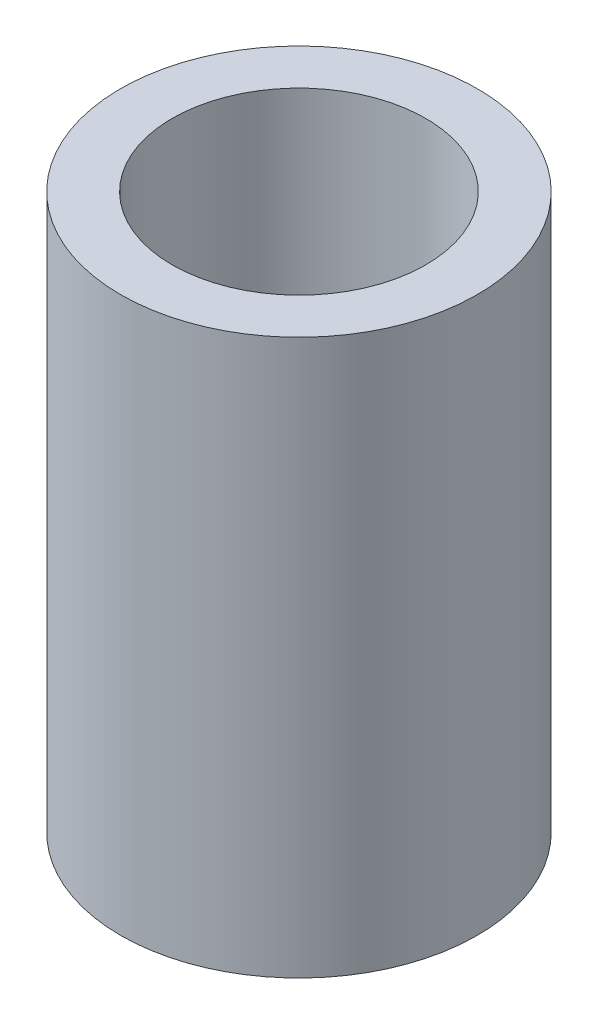
ISO-10303-21;
HEADER;
FILE_DESCRIPTION(('STEP AP214'),'2;1');
FILE_NAME('part.step','',(''),(''),'','','');
FILE_SCHEMA(('AUTOMOTIVE_DESIGN { 1 0 10303 214 1 1 1 1 }'));
ENDSEC;
DATA;
#1=APPLICATION_CONTEXT('core data for automotive mechanical design processes');
#2=APPLICATION_PROTOCOL_DEFINITION('international standard','automotive_design',2000,#1);
#3=PRODUCT_CONTEXT('',#1,'mechanical');
#4=PRODUCT('Part','Part','',(#3));
#5=PRODUCT_RELATED_PRODUCT_CATEGORY('part','',(#4));
#6=PRODUCT_DEFINITION_FORMATION('','',#4);
#7=PRODUCT_DEFINITION_CONTEXT('part definition',#1,'design');
#8=PRODUCT_DEFINITION('design','',#6,#7);
#9=PRODUCT_DEFINITION_SHAPE('','',#8);
#10=(LENGTH_UNIT() NAMED_UNIT(*) SI_UNIT(.MILLI.,.METRE.));
#11=(NAMED_UNIT(*) PLANE_ANGLE_UNIT() SI_UNIT($,.RADIAN.));
#12=(NAMED_UNIT(*) SI_UNIT($,.STERADIAN.) SOLID_ANGLE_UNIT());
#13=UNCERTAINTY_MEASURE_WITH_UNIT(LENGTH_MEASURE(1.E-05),#10,'distance_accuracy_value','');
#14=(GEOMETRIC_REPRESENTATION_CONTEXT(3) GLOBAL_UNCERTAINTY_ASSIGNED_CONTEXT((#13)) GLOBAL_UNIT_ASSIGNED_CONTEXT((#10,
#11,#12)) REPRESENTATION_CONTEXT('',''));
#15=CARTESIAN_POINT('',(0.,0.,0.));
#16=DIRECTION('',(0.,0.,1.));
#17=DIRECTION('',(1.,0.,0.));
#18=AXIS2_PLACEMENT_3D('',#15,#16,#17);
#19=CARTESIAN_POINT('',(0.,21.,0.));
#20=DIRECTION('',(0.,-1.,0.));
#21=DIRECTION('',(0.,0.,-1.));
#22=AXIS2_PLACEMENT_3D('',#19,#20,#21);
#23=CYLINDRICAL_SURFACE('',#22,6.75);
#24=CARTESIAN_POINT('',(0.,21.,0.));
#25=DIRECTION('',(0.,1.,0.));
#26=DIRECTION('',(0.,0.,1.));
#27=AXIS2_PLACEMENT_3D('',#24,#25,#26);
#28=CIRCLE('',#27,6.75);
#29=CARTESIAN_POINT('',(0.,21.,6.75));
#30=VERTEX_POINT('',#29);
#31=EDGE_CURVE('E11',#30,#30,#28,.T.);
#32=ORIENTED_EDGE('',*,*,#31,.F.);
#33=EDGE_LOOP('',(#32));
#34=FACE_BOUND('',#33,.T.);
#35=CARTESIAN_POINT('',(0.,0.,0.));
#36=DIRECTION('',(0.,1.,0.));
#37=DIRECTION('',(0.,0.,1.));
#38=AXIS2_PLACEMENT_3D('',#35,#36,#37);
#39=CIRCLE('',#38,6.75);
#40=CARTESIAN_POINT('',(0.,0.,6.75));
#41=VERTEX_POINT('',#40);
#42=EDGE_CURVE('E42',#41,#41,#39,.T.);
#43=ORIENTED_EDGE('',*,*,#42,.T.);
#44=EDGE_LOOP('',(#43));
#45=FACE_BOUND('',#44,.T.);
#46=ADVANCED_FACE('F39',(#34,#45),#23,.T.);
#47=CARTESIAN_POINT('',(0.,21.,0.));
#48=DIRECTION('',(0.,1.,0.));
#49=DIRECTION('',(0.,0.,1.));
#50=AXIS2_PLACEMENT_3D('',#47,#48,#49);
#51=PLANE('',#50);
#52=CARTESIAN_POINT('',(0.,21.,0.));
#53=DIRECTION('',(0.,1.,0.));
#54=DIRECTION('',(0.,0.,1.));
#55=AXIS2_PLACEMENT_3D('',#52,#53,#54);
#56=CIRCLE('',#55,4.8);
#57=CARTESIAN_POINT('',(0.,21.,4.8));
#58=VERTEX_POINT('',#57);
#59=EDGE_CURVE('E71',#58,#58,#56,.T.);
#60=ORIENTED_EDGE('',*,*,#59,.F.);
#61=EDGE_LOOP('',(#60));
#62=FACE_BOUND('',#61,.T.);
#63=ORIENTED_EDGE('',*,*,#31,.T.);
#64=EDGE_LOOP('',(#63));
#65=FACE_BOUND('',#64,.T.);
#66=ADVANCED_FACE('F100',(#62,#65),#51,.T.);
#67=CARTESIAN_POINT('',(0.,0.,0.));
#68=DIRECTION('',(0.,1.,0.));
#69=DIRECTION('',(0.,0.,1.));
#70=AXIS2_PLACEMENT_3D('',#67,#68,#69);
#71=PLANE('',#70);
#72=DIRECTION('',(1.,0.,0.));
#73=VECTOR('',#72,1.);
#74=CARTESIAN_POINT('',(-1.29747385997555,0.,-1.09843597113357));
#75=LINE('',#74,#73);
#76=CARTESIAN_POINT('',(-1.29747385997555,0.,-1.09843597113357));
#77=VERTEX_POINT('',#76);
#78=CARTESIAN_POINT('',(1.29747385997555,0.,-1.09843597113357));
#79=VERTEX_POINT('',#78);
#80=EDGE_CURVE('E75',#77,#79,#75,.T.);
#81=ORIENTED_EDGE('',*,*,#80,.F.);
#82=CARTESIAN_POINT('',(0.,0.,0.));
#83=DIRECTION('',(0.,-1.,0.));
#84=DIRECTION('',(0.,0.,-1.));
#85=AXIS2_PLACEMENT_3D('',#82,#83,#84);
#86=CIRCLE('',#85,1.7);
#87=EDGE_CURVE('E54',#79,#77,#86,.T.);
#88=ORIENTED_EDGE('',*,*,#87,.F.);
#89=EDGE_LOOP('',(#81,#88));
#90=FACE_BOUND('',#89,.T.);
#91=ORIENTED_EDGE('',*,*,#42,.F.);
#92=EDGE_LOOP('',(#91));
#93=FACE_BOUND('',#92,.T.);
#94=ADVANCED_FACE('F80',(#90,#93),#71,.F.);
#95=CARTESIAN_POINT('',(0.,11.,0.));
#96=DIRECTION('',(0.,1.,0.));
#97=DIRECTION('',(0.,0.,1.));
#98=AXIS2_PLACEMENT_3D('',#95,#96,#97);
#99=CYLINDRICAL_SURFACE('',#98,4.8);
#100=CARTESIAN_POINT('',(0.,11.,0.));
#101=DIRECTION('',(0.,1.,0.));
#102=DIRECTION('',(0.,0.,1.));
#103=AXIS2_PLACEMENT_3D('',#100,#101,#102);
#104=CIRCLE('',#103,4.8);
#105=CARTESIAN_POINT('',(0.,11.,4.8));
#106=VERTEX_POINT('',#105);
#107=EDGE_CURVE('E90',#106,#106,#104,.T.);
#108=ORIENTED_EDGE('',*,*,#107,.F.);
#109=EDGE_LOOP('',(#108));
#110=FACE_BOUND('',#109,.T.);
#111=ORIENTED_EDGE('',*,*,#59,.T.);
#112=EDGE_LOOP('',(#111));
#113=FACE_BOUND('',#112,.T.);
#114=ADVANCED_FACE('F98',(#110,#113),#99,.F.);
#115=CARTESIAN_POINT('',(0.,11.,0.));
#116=DIRECTION('',(0.,1.,0.));
#117=DIRECTION('',(0.,0.,1.));
#118=AXIS2_PLACEMENT_3D('',#115,#116,#117);
#119=PLANE('',#118);
#120=ORIENTED_EDGE('',*,*,#107,.T.);
#121=EDGE_LOOP('',(#120));
#122=FACE_BOUND('',#121,.T.);
#123=ADVANCED_FACE('F115',(#122),#119,.T.);
#124=CARTESIAN_POINT('',(0.,9.,0.));
#125=DIRECTION('',(0.,-1.,0.));
#126=DIRECTION('',(0.,0.,-1.));
#127=AXIS2_PLACEMENT_3D('',#124,#125,#126);
#128=CYLINDRICAL_SURFACE('',#127,1.7);
#129=ORIENTED_EDGE('',*,*,#87,.T.);
#130=DIRECTION('',(0.,-1.,0.));
#131=VECTOR('',#130,1.);
#132=CARTESIAN_POINT('',(-1.29747385997555,9.,-1.09843597113357));
#133=LINE('',#132,#131);
#134=CARTESIAN_POINT('',(-1.29747385997555,9.,-1.09843597113357));
#135=VERTEX_POINT('',#134);
#136=EDGE_CURVE('E72',#135,#77,#133,.T.);
#137=ORIENTED_EDGE('',*,*,#136,.F.);
#138=CARTESIAN_POINT('',(0.,9.,0.));
#139=DIRECTION('',(0.,-1.,0.));
#140=DIRECTION('',(0.,0.,-1.));
#141=AXIS2_PLACEMENT_3D('',#138,#139,#140);
#142=CIRCLE('',#141,1.7);
#143=CARTESIAN_POINT('',(1.29747385997555,9.,-1.09843597113357));
#144=VERTEX_POINT('',#143);
#145=EDGE_CURVE('E68',#144,#135,#142,.T.);
#146=ORIENTED_EDGE('',*,*,#145,.F.);
#147=DIRECTION('',(0.,-1.,0.));
#148=VECTOR('',#147,1.);
#149=CARTESIAN_POINT('',(1.29747385997555,9.,-1.09843597113357));
#150=LINE('',#149,#148);
#151=EDGE_CURVE('E62',#144,#79,#150,.T.);
#152=ORIENTED_EDGE('',*,*,#151,.T.);
#153=EDGE_LOOP('',(#129,#137,#146,#152));
#154=FACE_BOUND('',#153,.T.);
#155=ADVANCED_FACE('F66',(#154),#128,.F.);
#156=CARTESIAN_POINT('',(-1.29747385997555,9.,-1.09843597113357));
#157=DIRECTION('',(0.,0.,-1.));
#158=DIRECTION('',(-1.,0.,0.));
#159=AXIS2_PLACEMENT_3D('',#156,#157,#158);
#160=PLANE('',#159);
#161=ORIENTED_EDGE('',*,*,#80,.T.);
#162=ORIENTED_EDGE('',*,*,#151,.F.);
#163=DIRECTION('',(1.,0.,0.));
#164=VECTOR('',#163,1.);
#165=CARTESIAN_POINT('',(-1.29747385997555,9.,-1.09843597113357));
#166=LINE('',#165,#164);
#167=EDGE_CURVE('E85',#135,#144,#166,.T.);
#168=ORIENTED_EDGE('',*,*,#167,.F.);
#169=ORIENTED_EDGE('',*,*,#136,.T.);
#170=EDGE_LOOP('',(#161,#162,#168,#169));
#171=FACE_BOUND('',#170,.T.);
#172=ADVANCED_FACE('F76',(#171),#160,.F.);
#173=CARTESIAN_POINT('',(0.,9.,0.));
#174=DIRECTION('',(0.,-1.,0.));
#175=DIRECTION('',(0.,0.,-1.));
#176=AXIS2_PLACEMENT_3D('',#173,#174,#175);
#177=PLANE('',#176);
#178=ORIENTED_EDGE('',*,*,#145,.T.);
#179=ORIENTED_EDGE('',*,*,#167,.T.);
#180=EDGE_LOOP('',(#178,#179));
#181=FACE_BOUND('',#180,.T.);
#182=ADVANCED_FACE('F126',(#181),#177,.T.);
#183=CLOSED_SHELL('',(#46,#66,#94,#114,#123,#155,#172,#182));
#184=MANIFOLD_SOLID_BREP('B2',#183);
#185=ADVANCED_BREP_SHAPE_REPRESENTATION('',(#18,#184),#14);
#186=SHAPE_DEFINITION_REPRESENTATION(#9,#185);
ENDSEC;
END-ISO-10303-21;
